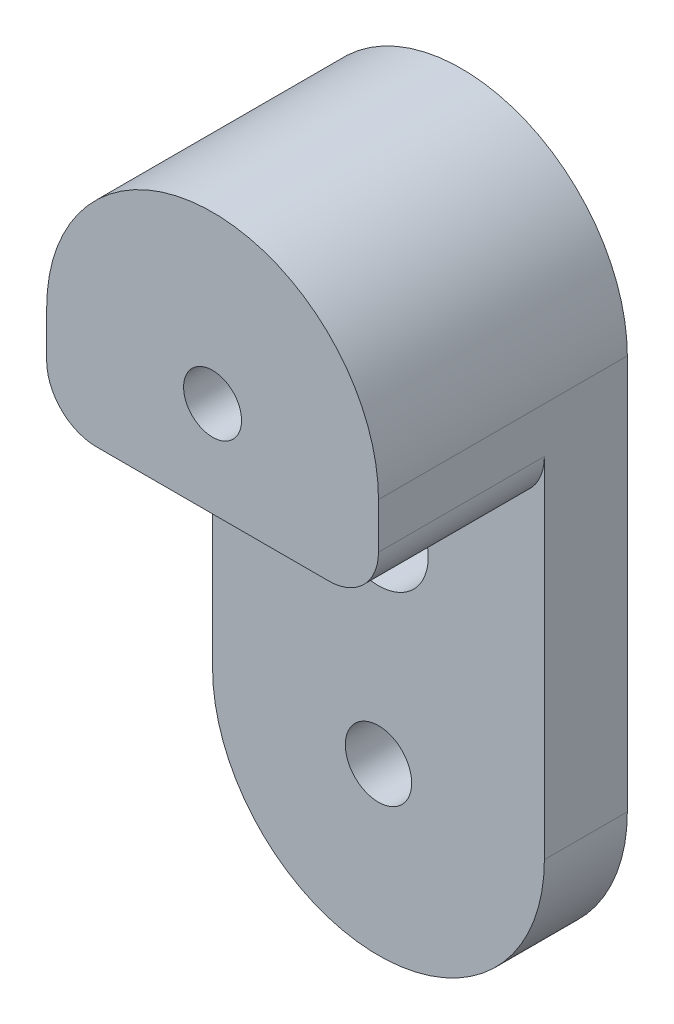
ISO-10303-21;
HEADER;
FILE_DESCRIPTION(('STEP AP214'),'2;1');
FILE_NAME('part.step','',(''),(''),'','','');
FILE_SCHEMA(('AUTOMOTIVE_DESIGN { 1 0 10303 214 1 1 1 1 }'));
ENDSEC;
DATA;
#1=APPLICATION_CONTEXT('core data for automotive mechanical design processes');
#2=APPLICATION_PROTOCOL_DEFINITION('international standard','automotive_design',2000,#1);
#3=PRODUCT_CONTEXT('',#1,'mechanical');
#4=PRODUCT('Part','Part','',(#3));
#5=PRODUCT_RELATED_PRODUCT_CATEGORY('part','',(#4));
#6=PRODUCT_DEFINITION_FORMATION('','',#4);
#7=PRODUCT_DEFINITION_CONTEXT('part definition',#1,'design');
#8=PRODUCT_DEFINITION('design','',#6,#7);
#9=PRODUCT_DEFINITION_SHAPE('','',#8);
#10=(LENGTH_UNIT() NAMED_UNIT(*) SI_UNIT(.MILLI.,.METRE.));
#11=(NAMED_UNIT(*) PLANE_ANGLE_UNIT() SI_UNIT($,.RADIAN.));
#12=(NAMED_UNIT(*) SI_UNIT($,.STERADIAN.) SOLID_ANGLE_UNIT());
#13=UNCERTAINTY_MEASURE_WITH_UNIT(LENGTH_MEASURE(1.E-05),#10,'distance_accuracy_value','');
#14=(GEOMETRIC_REPRESENTATION_CONTEXT(3) GLOBAL_UNCERTAINTY_ASSIGNED_CONTEXT((#13)) GLOBAL_UNIT_ASSIGNED_CONTEXT((#10,
#11,#12)) REPRESENTATION_CONTEXT('',''));
#15=CARTESIAN_POINT('',(0.,0.,0.));
#16=DIRECTION('',(0.,0.,1.));
#17=DIRECTION('',(1.,0.,0.));
#18=AXIS2_PLACEMENT_3D('',#15,#16,#17);
#19=CARTESIAN_POINT('',(-10.,0.,5.));
#20=DIRECTION('',(1.,0.,0.));
#21=DIRECTION('',(0.,1.,0.));
#22=AXIS2_PLACEMENT_3D('',#19,#20,#21);
#23=PLANE('',#22);
#24=DIRECTION('',(0.,-1.,0.));
#25=VECTOR('',#24,1.);
#26=CARTESIAN_POINT('',(-10.,0.,5.));
#27=LINE('',#26,#25);
#28=CARTESIAN_POINT('',(-10.,-2.75,5.));
#29=VERTEX_POINT('',#28);
#30=CARTESIAN_POINT('',(-10.,-23.8,5.));
#31=VERTEX_POINT('',#30);
#32=EDGE_CURVE('E50',#29,#31,#27,.T.);
#33=ORIENTED_EDGE('',*,*,#32,.F.);
#34=DIRECTION('',(0.,0.,-1.));
#35=VECTOR('',#34,1.);
#36=CARTESIAN_POINT('',(-10.,-2.75,5.));
#37=LINE('',#36,#35);
#38=CARTESIAN_POINT('',(-10.,-2.75,15.));
#39=VERTEX_POINT('',#38);
#40=EDGE_CURVE('E54',#29,#39,#37,.F.);
#41=ORIENTED_EDGE('',*,*,#40,.T.);
#42=DIRECTION('',(0.,-1.,0.));
#43=VECTOR('',#42,1.);
#44=CARTESIAN_POINT('',(-10.,0.,15.));
#45=LINE('',#44,#43);
#46=CARTESIAN_POINT('',(-10.,0.,15.));
#47=VERTEX_POINT('',#46);
#48=EDGE_CURVE('E129',#47,#39,#45,.T.);
#49=ORIENTED_EDGE('',*,*,#48,.F.);
#50=DIRECTION('',(0.,0.,-1.));
#51=VECTOR('',#50,1.);
#52=CARTESIAN_POINT('',(-10.,0.,15.));
#53=LINE('',#52,#51);
#54=CARTESIAN_POINT('',(-10.,0.,0.));
#55=VERTEX_POINT('',#54);
#56=EDGE_CURVE('E113',#47,#55,#53,.T.);
#57=ORIENTED_EDGE('',*,*,#56,.T.);
#58=DIRECTION('',(0.,-1.,0.));
#59=VECTOR('',#58,1.);
#60=CARTESIAN_POINT('',(-10.,0.,0.));
#61=LINE('',#60,#59);
#62=CARTESIAN_POINT('',(-10.,-23.8,0.));
#63=VERTEX_POINT('',#62);
#64=EDGE_CURVE('E162',#55,#63,#61,.T.);
#65=ORIENTED_EDGE('',*,*,#64,.T.);
#66=DIRECTION('',(0.,0.,-1.));
#67=VECTOR('',#66,1.);
#68=CARTESIAN_POINT('',(-10.,-23.8,5.));
#69=LINE('',#68,#67);
#70=EDGE_CURVE('E170',#31,#63,#69,.T.);
#71=ORIENTED_EDGE('',*,*,#70,.F.);
#72=EDGE_LOOP('',(#33,#41,#49,#57,#65,#71));
#73=FACE_BOUND('',#72,.T.);
#74=ADVANCED_FACE('F35',(#73),#23,.F.);
#75=CARTESIAN_POINT('',(0.,-23.8,5.));
#76=DIRECTION('',(0.,0.,-1.));
#77=DIRECTION('',(-1.,0.,0.));
#78=AXIS2_PLACEMENT_3D('',#75,#76,#77);
#79=CYLINDRICAL_SURFACE('',#78,10.);
#80=CARTESIAN_POINT('',(0.,-23.8,0.));
#81=DIRECTION('',(0.,0.,1.));
#82=DIRECTION('',(1.,0.,0.));
#83=AXIS2_PLACEMENT_3D('',#80,#81,#82);
#84=CIRCLE('',#83,10.);
#85=CARTESIAN_POINT('',(10.,-23.8,0.));
#86=VERTEX_POINT('',#85);
#87=EDGE_CURVE('E165',#63,#86,#84,.T.);
#88=ORIENTED_EDGE('',*,*,#87,.T.);
#89=DIRECTION('',(0.,0.,-1.));
#90=VECTOR('',#89,1.);
#91=CARTESIAN_POINT('',(10.,-23.8,5.));
#92=LINE('',#91,#90);
#93=CARTESIAN_POINT('',(10.,-23.8,5.));
#94=VERTEX_POINT('',#93);
#95=EDGE_CURVE('E156',#94,#86,#92,.T.);
#96=ORIENTED_EDGE('',*,*,#95,.F.);
#97=CARTESIAN_POINT('',(0.,-23.8,5.));
#98=DIRECTION('',(0.,0.,1.));
#99=DIRECTION('',(1.,0.,0.));
#100=AXIS2_PLACEMENT_3D('',#97,#98,#99);
#101=CIRCLE('',#100,10.);
#102=EDGE_CURVE('E148',#31,#94,#101,.T.);
#103=ORIENTED_EDGE('',*,*,#102,.F.);
#104=ORIENTED_EDGE('',*,*,#70,.T.);
#105=EDGE_LOOP('',(#88,#96,#103,#104));
#106=FACE_BOUND('',#105,.T.);
#107=ADVANCED_FACE('F196',(#106),#79,.T.);
#108=CARTESIAN_POINT('',(10.,0.,5.));
#109=DIRECTION('',(1.,0.,0.));
#110=DIRECTION('',(0.,1.,0.));
#111=AXIS2_PLACEMENT_3D('',#108,#109,#110);
#112=PLANE('',#111);
#113=DIRECTION('',(0.,-1.,0.));
#114=VECTOR('',#113,1.);
#115=CARTESIAN_POINT('',(10.,0.,15.));
#116=LINE('',#115,#114);
#117=CARTESIAN_POINT('',(10.,0.,15.));
#118=VERTEX_POINT('',#117);
#119=CARTESIAN_POINT('',(10.,-2.75,15.));
#120=VERTEX_POINT('',#119);
#121=EDGE_CURVE('E105',#118,#120,#116,.T.);
#122=ORIENTED_EDGE('',*,*,#121,.T.);
#123=DIRECTION('',(0.,0.,-1.));
#124=VECTOR('',#123,1.);
#125=CARTESIAN_POINT('',(10.,-2.75,5.));
#126=LINE('',#125,#124);
#127=CARTESIAN_POINT('',(10.,-2.75,5.));
#128=VERTEX_POINT('',#127);
#129=EDGE_CURVE('E173',#120,#128,#126,.T.);
#130=ORIENTED_EDGE('',*,*,#129,.T.);
#131=DIRECTION('',(0.,-1.,0.));
#132=VECTOR('',#131,1.);
#133=CARTESIAN_POINT('',(10.,0.,5.));
#134=LINE('',#133,#132);
#135=EDGE_CURVE('E150',#128,#94,#134,.T.);
#136=ORIENTED_EDGE('',*,*,#135,.T.);
#137=ORIENTED_EDGE('',*,*,#95,.T.);
#138=DIRECTION('',(0.,-1.,0.));
#139=VECTOR('',#138,1.);
#140=CARTESIAN_POINT('',(10.,0.,0.));
#141=LINE('',#140,#139);
#142=CARTESIAN_POINT('',(10.,0.,0.));
#143=VERTEX_POINT('',#142);
#144=EDGE_CURVE('E108',#143,#86,#141,.T.);
#145=ORIENTED_EDGE('',*,*,#144,.F.);
#146=DIRECTION('',(0.,0.,-1.));
#147=VECTOR('',#146,1.);
#148=CARTESIAN_POINT('',(10.,0.,15.));
#149=LINE('',#148,#147);
#150=EDGE_CURVE('E100',#118,#143,#149,.T.);
#151=ORIENTED_EDGE('',*,*,#150,.F.);
#152=EDGE_LOOP('',(#122,#130,#136,#137,#145,#151));
#153=FACE_BOUND('',#152,.T.);
#154=ADVANCED_FACE('F102',(#153),#112,.T.);
#155=CARTESIAN_POINT('',(0.,-23.8,5.));
#156=DIRECTION('',(0.,0.,-1.));
#157=DIRECTION('',(-1.,0.,0.));
#158=AXIS2_PLACEMENT_3D('',#155,#156,#157);
#159=CYLINDRICAL_SURFACE('',#158,2.);
#160=CARTESIAN_POINT('',(0.,-23.8,5.));
#161=DIRECTION('',(0.,0.,1.));
#162=DIRECTION('',(1.,0.,0.));
#163=AXIS2_PLACEMENT_3D('',#160,#161,#162);
#164=CIRCLE('',#163,2.);
#165=CARTESIAN_POINT('',(2.00000000000001,-23.8,5.));
#166=VERTEX_POINT('',#165);
#167=EDGE_CURVE('E144',#166,#166,#164,.T.);
#168=ORIENTED_EDGE('',*,*,#167,.T.);
#169=EDGE_LOOP('',(#168));
#170=FACE_BOUND('',#169,.T.);
#171=CARTESIAN_POINT('',(0.,-23.8,0.));
#172=DIRECTION('',(0.,0.,1.));
#173=DIRECTION('',(1.,0.,0.));
#174=AXIS2_PLACEMENT_3D('',#171,#172,#173);
#175=CIRCLE('',#174,2.);
#176=CARTESIAN_POINT('',(2.00000000000001,-23.8,0.));
#177=VERTEX_POINT('',#176);
#178=EDGE_CURVE('E159',#177,#177,#175,.T.);
#179=ORIENTED_EDGE('',*,*,#178,.F.);
#180=EDGE_LOOP('',(#179));
#181=FACE_BOUND('',#180,.T.);
#182=ADVANCED_FACE('F214',(#170,#181),#159,.F.);
#183=CARTESIAN_POINT('',(0.,-11.5,5.));
#184=DIRECTION('',(0.,0.,-1.));
#185=DIRECTION('',(-1.,0.,0.));
#186=AXIS2_PLACEMENT_3D('',#183,#184,#185);
#187=CYLINDRICAL_SURFACE('',#186,3.);
#188=CARTESIAN_POINT('',(0.,-11.5,5.));
#189=DIRECTION('',(0.,0.,1.));
#190=DIRECTION('',(1.,0.,0.));
#191=AXIS2_PLACEMENT_3D('',#188,#189,#190);
#192=CIRCLE('',#191,3.);
#193=CARTESIAN_POINT('',(3.,-11.5,5.));
#194=VERTEX_POINT('',#193);
#195=EDGE_CURVE('E141',#194,#194,#192,.T.);
#196=ORIENTED_EDGE('',*,*,#195,.T.);
#197=EDGE_LOOP('',(#196));
#198=FACE_BOUND('',#197,.T.);
#199=CARTESIAN_POINT('',(0.,-11.5,0.));
#200=DIRECTION('',(0.,0.,1.));
#201=DIRECTION('',(1.,0.,0.));
#202=AXIS2_PLACEMENT_3D('',#199,#200,#201);
#203=CIRCLE('',#202,3.);
#204=CARTESIAN_POINT('',(3.,-11.5,0.));
#205=VERTEX_POINT('',#204);
#206=EDGE_CURVE('E112',#205,#205,#203,.T.);
#207=ORIENTED_EDGE('',*,*,#206,.F.);
#208=EDGE_LOOP('',(#207));
#209=FACE_BOUND('',#208,.T.);
#210=ADVANCED_FACE('F217',(#198,#209),#187,.F.);
#211=CARTESIAN_POINT('',(0.,0.,5.));
#212=DIRECTION('',(0.,0.,1.));
#213=DIRECTION('',(1.,0.,0.));
#214=AXIS2_PLACEMENT_3D('',#211,#212,#213);
#215=PLANE('',#214);
#216=ORIENTED_EDGE('',*,*,#195,.F.);
#217=EDGE_LOOP('',(#216));
#218=FACE_BOUND('',#217,.T.);
#219=ORIENTED_EDGE('',*,*,#167,.F.);
#220=EDGE_LOOP('',(#219));
#221=FACE_BOUND('',#220,.T.);
#222=ORIENTED_EDGE('',*,*,#32,.T.);
#223=ORIENTED_EDGE('',*,*,#102,.T.);
#224=ORIENTED_EDGE('',*,*,#135,.F.);
#225=CARTESIAN_POINT('',(7.,-2.75,5.));
#226=DIRECTION('',(0.,0.,1.));
#227=DIRECTION('',(1.,0.,0.));
#228=AXIS2_PLACEMENT_3D('',#225,#226,#227);
#229=CIRCLE('',#228,3.);
#230=CARTESIAN_POINT('',(7.,-5.75,5.));
#231=VERTEX_POINT('',#230);
#232=EDGE_CURVE('E43',#128,#231,#229,.F.);
#233=ORIENTED_EDGE('',*,*,#232,.T.);
#234=DIRECTION('',(1.,0.,0.));
#235=VECTOR('',#234,1.);
#236=CARTESIAN_POINT('',(0.,-5.75,5.));
#237=LINE('',#236,#235);
#238=CARTESIAN_POINT('',(-7.,-5.75,5.));
#239=VERTEX_POINT('',#238);
#240=EDGE_CURVE('E153',#239,#231,#237,.T.);
#241=ORIENTED_EDGE('',*,*,#240,.F.);
#242=CARTESIAN_POINT('',(-7.,-2.75,5.));
#243=DIRECTION('',(0.,0.,1.));
#244=DIRECTION('',(1.,0.,0.));
#245=AXIS2_PLACEMENT_3D('',#242,#243,#244);
#246=CIRCLE('',#245,3.);
#247=EDGE_CURVE('E11',#239,#29,#246,.F.);
#248=ORIENTED_EDGE('',*,*,#247,.T.);
#249=EDGE_LOOP('',(#222,#223,#224,#233,#241,#248));
#250=FACE_BOUND('',#249,.T.);
#251=ADVANCED_FACE('F186',(#218,#221,#250),#215,.T.);
#252=CARTESIAN_POINT('',(0.,0.,0.));
#253=DIRECTION('',(0.,0.,1.));
#254=DIRECTION('',(1.,0.,0.));
#255=AXIS2_PLACEMENT_3D('',#252,#253,#254);
#256=PLANE('',#255);
#257=ORIENTED_EDGE('',*,*,#206,.T.);
#258=EDGE_LOOP('',(#257));
#259=FACE_BOUND('',#258,.T.);
#260=ORIENTED_EDGE('',*,*,#178,.T.);
#261=EDGE_LOOP('',(#260));
#262=FACE_BOUND('',#261,.T.);
#263=ORIENTED_EDGE('',*,*,#64,.F.);
#264=CARTESIAN_POINT('',(0.,0.,0.));
#265=DIRECTION('',(0.,0.,1.));
#266=DIRECTION('',(1.,0.,0.));
#267=AXIS2_PLACEMENT_3D('',#264,#265,#266);
#268=CIRCLE('',#267,10.);
#269=EDGE_CURVE('E135',#143,#55,#268,.T.);
#270=ORIENTED_EDGE('',*,*,#269,.F.);
#271=ORIENTED_EDGE('',*,*,#144,.T.);
#272=ORIENTED_EDGE('',*,*,#87,.F.);
#273=EDGE_LOOP('',(#263,#270,#271,#272));
#274=FACE_BOUND('',#273,.T.);
#275=CARTESIAN_POINT('',(0.,0.,0.));
#276=DIRECTION('',(0.,0.,1.));
#277=DIRECTION('',(1.,0.,0.));
#278=AXIS2_PLACEMENT_3D('',#275,#276,#277);
#279=CIRCLE('',#278,1.74625);
#280=CARTESIAN_POINT('',(1.74625,0.,0.));
#281=VERTEX_POINT('',#280);
#282=EDGE_CURVE('E137',#281,#281,#279,.T.);
#283=ORIENTED_EDGE('',*,*,#282,.T.);
#284=EDGE_LOOP('',(#283));
#285=FACE_BOUND('',#284,.T.);
#286=ADVANCED_FACE('F198',(#259,#262,#274,#285),#256,.F.);
#287=CARTESIAN_POINT('',(0.,-5.75,15.));
#288=DIRECTION('',(0.,1.,0.));
#289=DIRECTION('',(-1.,0.,0.));
#290=AXIS2_PLACEMENT_3D('',#287,#288,#289);
#291=PLANE('',#290);
#292=ORIENTED_EDGE('',*,*,#240,.T.);
#293=DIRECTION('',(0.,0.,-1.));
#294=VECTOR('',#293,1.);
#295=CARTESIAN_POINT('',(7.,-5.75,15.));
#296=LINE('',#295,#294);
#297=CARTESIAN_POINT('',(7.,-5.75,15.));
#298=VERTEX_POINT('',#297);
#299=EDGE_CURVE('E178',#231,#298,#296,.F.);
#300=ORIENTED_EDGE('',*,*,#299,.T.);
#301=DIRECTION('',(1.,0.,0.));
#302=VECTOR('',#301,1.);
#303=CARTESIAN_POINT('',(0.,-5.75,15.));
#304=LINE('',#303,#302);
#305=CARTESIAN_POINT('',(-7.,-5.75,15.));
#306=VERTEX_POINT('',#305);
#307=EDGE_CURVE('E127',#306,#298,#304,.T.);
#308=ORIENTED_EDGE('',*,*,#307,.F.);
#309=DIRECTION('',(0.,0.,-1.));
#310=VECTOR('',#309,1.);
#311=CARTESIAN_POINT('',(-7.,-5.75,15.));
#312=LINE('',#311,#310);
#313=EDGE_CURVE('E175',#306,#239,#312,.T.);
#314=ORIENTED_EDGE('',*,*,#313,.T.);
#315=EDGE_LOOP('',(#292,#300,#308,#314));
#316=FACE_BOUND('',#315,.T.);
#317=ADVANCED_FACE('F190',(#316),#291,.F.);
#318=CARTESIAN_POINT('',(0.,0.,15.));
#319=DIRECTION('',(0.,0.,-1.));
#320=DIRECTION('',(-1.,0.,0.));
#321=AXIS2_PLACEMENT_3D('',#318,#319,#320);
#322=CYLINDRICAL_SURFACE('',#321,10.);
#323=ORIENTED_EDGE('',*,*,#269,.T.);
#324=ORIENTED_EDGE('',*,*,#56,.F.);
#325=CARTESIAN_POINT('',(0.,0.,15.));
#326=DIRECTION('',(0.,0.,1.));
#327=DIRECTION('',(1.,0.,0.));
#328=AXIS2_PLACEMENT_3D('',#325,#326,#327);
#329=CIRCLE('',#328,10.);
#330=EDGE_CURVE('E116',#118,#47,#329,.T.);
#331=ORIENTED_EDGE('',*,*,#330,.F.);
#332=ORIENTED_EDGE('',*,*,#150,.T.);
#333=EDGE_LOOP('',(#323,#324,#331,#332));
#334=FACE_BOUND('',#333,.T.);
#335=ADVANCED_FACE('F117',(#334),#322,.T.);
#336=CARTESIAN_POINT('',(0.,0.,15.));
#337=DIRECTION('',(0.,0.,-1.));
#338=DIRECTION('',(-1.,0.,0.));
#339=AXIS2_PLACEMENT_3D('',#336,#337,#338);
#340=CYLINDRICAL_SURFACE('',#339,1.74625);
#341=CARTESIAN_POINT('',(0.,0.,15.));
#342=DIRECTION('',(0.,0.,1.));
#343=DIRECTION('',(1.,0.,0.));
#344=AXIS2_PLACEMENT_3D('',#341,#342,#343);
#345=CIRCLE('',#344,1.74625);
#346=CARTESIAN_POINT('',(1.74625,0.,15.));
#347=VERTEX_POINT('',#346);
#348=EDGE_CURVE('E120',#347,#347,#345,.T.);
#349=ORIENTED_EDGE('',*,*,#348,.T.);
#350=EDGE_LOOP('',(#349));
#351=FACE_BOUND('',#350,.T.);
#352=ORIENTED_EDGE('',*,*,#282,.F.);
#353=EDGE_LOOP('',(#352));
#354=FACE_BOUND('',#353,.T.);
#355=ADVANCED_FACE('F272',(#351,#354),#340,.F.);
#356=CARTESIAN_POINT('',(0.,0.,15.));
#357=DIRECTION('',(0.,0.,1.));
#358=DIRECTION('',(1.,0.,0.));
#359=AXIS2_PLACEMENT_3D('',#356,#357,#358);
#360=PLANE('',#359);
#361=ORIENTED_EDGE('',*,*,#307,.T.);
#362=CARTESIAN_POINT('',(7.,-2.75,15.));
#363=DIRECTION('',(0.,0.,1.));
#364=DIRECTION('',(1.,0.,0.));
#365=AXIS2_PLACEMENT_3D('',#362,#363,#364);
#366=CIRCLE('',#365,3.);
#367=EDGE_CURVE('E126',#298,#120,#366,.T.);
#368=ORIENTED_EDGE('',*,*,#367,.T.);
#369=ORIENTED_EDGE('',*,*,#121,.F.);
#370=ORIENTED_EDGE('',*,*,#330,.T.);
#371=ORIENTED_EDGE('',*,*,#48,.T.);
#372=CARTESIAN_POINT('',(-7.,-2.75,15.));
#373=DIRECTION('',(0.,0.,1.));
#374=DIRECTION('',(1.,0.,0.));
#375=AXIS2_PLACEMENT_3D('',#372,#373,#374);
#376=CIRCLE('',#375,3.);
#377=EDGE_CURVE('E180',#39,#306,#376,.T.);
#378=ORIENTED_EDGE('',*,*,#377,.T.);
#379=EDGE_LOOP('',(#361,#368,#369,#370,#371,#378));
#380=FACE_BOUND('',#379,.T.);
#381=ORIENTED_EDGE('',*,*,#348,.F.);
#382=EDGE_LOOP('',(#381));
#383=FACE_BOUND('',#382,.T.);
#384=ADVANCED_FACE('F123',(#380,#383),#360,.T.);
#385=CARTESIAN_POINT('',(7.,-2.75,5.));
#386=DIRECTION('',(0.,0.,1.));
#387=DIRECTION('',(1.,0.,0.));
#388=AXIS2_PLACEMENT_3D('',#385,#386,#387);
#389=CYLINDRICAL_SURFACE('',#388,3.);
#390=ORIENTED_EDGE('',*,*,#367,.F.);
#391=ORIENTED_EDGE('',*,*,#299,.F.);
#392=ORIENTED_EDGE('',*,*,#232,.F.);
#393=ORIENTED_EDGE('',*,*,#129,.F.);
#394=EDGE_LOOP('',(#390,#391,#392,#393));
#395=FACE_BOUND('',#394,.T.);
#396=ADVANCED_FACE('F193',(#395),#389,.T.);
#397=CARTESIAN_POINT('',(-7.,-2.75,15.));
#398=DIRECTION('',(0.,0.,-1.));
#399=DIRECTION('',(-1.,0.,0.));
#400=AXIS2_PLACEMENT_3D('',#397,#398,#399);
#401=CYLINDRICAL_SURFACE('',#400,3.);
#402=ORIENTED_EDGE('',*,*,#377,.F.);
#403=ORIENTED_EDGE('',*,*,#40,.F.);
#404=ORIENTED_EDGE('',*,*,#247,.F.);
#405=ORIENTED_EDGE('',*,*,#313,.F.);
#406=EDGE_LOOP('',(#402,#403,#404,#405));
#407=FACE_BOUND('',#406,.T.);
#408=ADVANCED_FACE('F37',(#407),#401,.T.);
#409=CLOSED_SHELL('',(#74,#107,#154,#182,#210,#251,#286,#317,#335,#355,#384,#396,#408));
#410=MANIFOLD_SOLID_BREP('B2',#409);
#411=ADVANCED_BREP_SHAPE_REPRESENTATION('',(#18,#410),#14);
#412=SHAPE_DEFINITION_REPRESENTATION(#9,#411);
ENDSEC;
END-ISO-10303-21;
